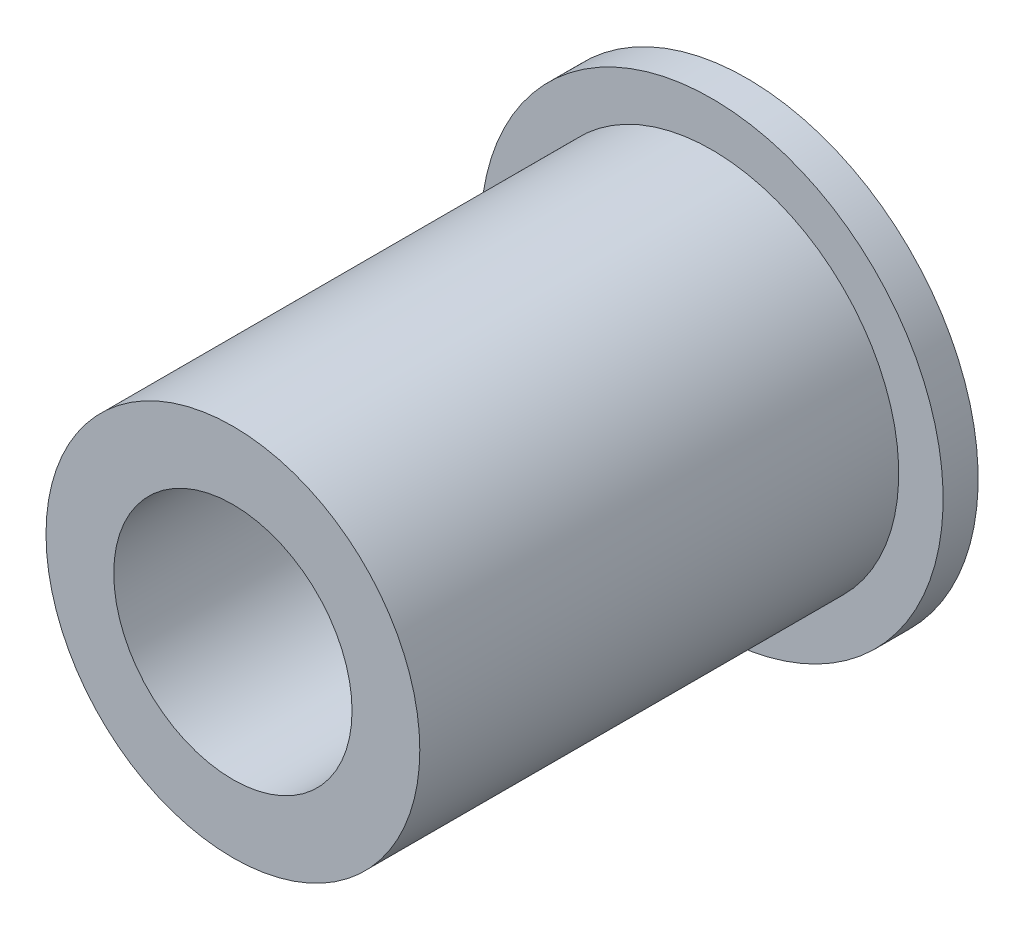
ISO-10303-21;
HEADER;
FILE_DESCRIPTION(('STEP AP214'),'2;1');
FILE_NAME('part.step','',(''),(''),'','','');
FILE_SCHEMA(('AUTOMOTIVE_DESIGN { 1 0 10303 214 1 1 1 1 }'));
ENDSEC;
DATA;
#1=APPLICATION_CONTEXT('core data for automotive mechanical design processes');
#2=APPLICATION_PROTOCOL_DEFINITION('international standard','automotive_design',2000,#1);
#3=PRODUCT_CONTEXT('',#1,'mechanical');
#4=PRODUCT('Part','Part','',(#3));
#5=PRODUCT_RELATED_PRODUCT_CATEGORY('part','',(#4));
#6=PRODUCT_DEFINITION_FORMATION('','',#4);
#7=PRODUCT_DEFINITION_CONTEXT('part definition',#1,'design');
#8=PRODUCT_DEFINITION('design','',#6,#7);
#9=PRODUCT_DEFINITION_SHAPE('','',#8);
#10=(LENGTH_UNIT() NAMED_UNIT(*) SI_UNIT(.MILLI.,.METRE.));
#11=(NAMED_UNIT(*) PLANE_ANGLE_UNIT() SI_UNIT($,.RADIAN.));
#12=(NAMED_UNIT(*) SI_UNIT($,.STERADIAN.) SOLID_ANGLE_UNIT());
#13=UNCERTAINTY_MEASURE_WITH_UNIT(LENGTH_MEASURE(1.E-05),#10,'distance_accuracy_value','');
#14=(GEOMETRIC_REPRESENTATION_CONTEXT(3) GLOBAL_UNCERTAINTY_ASSIGNED_CONTEXT((#13)) GLOBAL_UNIT_ASSIGNED_CONTEXT((#10,
#11,#12)) REPRESENTATION_CONTEXT('',''));
#15=CARTESIAN_POINT('',(0.,0.,0.));
#16=DIRECTION('',(0.,0.,1.));
#17=DIRECTION('',(1.,0.,0.));
#18=AXIS2_PLACEMENT_3D('',#15,#16,#17);
#19=CARTESIAN_POINT('',(0.,0.,22.));
#20=DIRECTION('',(0.,0.,-1.));
#21=DIRECTION('',(-1.,0.,0.));
#22=AXIS2_PLACEMENT_3D('',#19,#20,#21);
#23=CYLINDRICAL_SURFACE('',#22,8.);
#24=CARTESIAN_POINT('',(0.,0.,22.));
#25=DIRECTION('',(0.,0.,1.));
#26=DIRECTION('',(1.,0.,0.));
#27=AXIS2_PLACEMENT_3D('',#24,#25,#26);
#28=CIRCLE('',#27,8.);
#29=CARTESIAN_POINT('',(8.,0.,22.));
#30=VERTEX_POINT('',#29);
#31=EDGE_CURVE('E47',#30,#30,#28,.T.);
#32=ORIENTED_EDGE('',*,*,#31,.F.);
#33=EDGE_LOOP('',(#32));
#34=FACE_BOUND('',#33,.T.);
#35=CARTESIAN_POINT('',(0.,0.,1.5));
#36=DIRECTION('',(0.,0.,-1.));
#37=DIRECTION('',(-1.,0.,0.));
#38=AXIS2_PLACEMENT_3D('',#35,#36,#37);
#39=CIRCLE('',#38,8.);
#40=CARTESIAN_POINT('',(-8.,0.,1.5));
#41=VERTEX_POINT('',#40);
#42=EDGE_CURVE('E11',#41,#41,#39,.T.);
#43=ORIENTED_EDGE('',*,*,#42,.F.);
#44=EDGE_LOOP('',(#43));
#45=FACE_BOUND('',#44,.T.);
#46=ADVANCED_FACE('F39',(#34,#45),#23,.T.);
#47=CARTESIAN_POINT('',(0.,0.,22.));
#48=DIRECTION('',(0.,0.,1.));
#49=DIRECTION('',(1.,0.,0.));
#50=AXIS2_PLACEMENT_3D('',#47,#48,#49);
#51=PLANE('',#50);
#52=CARTESIAN_POINT('',(0.,0.,22.));
#53=DIRECTION('',(0.,0.,1.));
#54=DIRECTION('',(1.,0.,0.));
#55=AXIS2_PLACEMENT_3D('',#52,#53,#54);
#56=CIRCLE('',#55,5.1);
#57=CARTESIAN_POINT('',(5.1,0.,22.));
#58=VERTEX_POINT('',#57);
#59=EDGE_CURVE('E96',#58,#58,#56,.T.);
#60=ORIENTED_EDGE('',*,*,#59,.F.);
#61=EDGE_LOOP('',(#60));
#62=FACE_BOUND('',#61,.T.);
#63=ORIENTED_EDGE('',*,*,#31,.T.);
#64=EDGE_LOOP('',(#63));
#65=FACE_BOUND('',#64,.T.);
#66=ADVANCED_FACE('F110',(#62,#65),#51,.T.);
#67=CARTESIAN_POINT('',(0.,0.,9.));
#68=DIRECTION('',(0.,0.,1.));
#69=DIRECTION('',(1.,0.,0.));
#70=AXIS2_PLACEMENT_3D('',#67,#68,#69);
#71=CYLINDRICAL_SURFACE('',#70,5.1);
#72=CARTESIAN_POINT('',(0.,0.,9.));
#73=DIRECTION('',(0.,0.,1.));
#74=DIRECTION('',(1.,0.,0.));
#75=AXIS2_PLACEMENT_3D('',#72,#73,#74);
#76=CIRCLE('',#75,5.1);
#77=CARTESIAN_POINT('',(5.1,0.,9.));
#78=VERTEX_POINT('',#77);
#79=EDGE_CURVE('E100',#78,#78,#76,.T.);
#80=ORIENTED_EDGE('',*,*,#79,.F.);
#81=EDGE_LOOP('',(#80));
#82=FACE_BOUND('',#81,.T.);
#83=ORIENTED_EDGE('',*,*,#59,.T.);
#84=EDGE_LOOP('',(#83));
#85=FACE_BOUND('',#84,.T.);
#86=ADVANCED_FACE('F136',(#82,#85),#71,.F.);
#87=CARTESIAN_POINT('',(0.,0.,9.));
#88=DIRECTION('',(0.,0.,1.));
#89=DIRECTION('',(1.,0.,0.));
#90=AXIS2_PLACEMENT_3D('',#87,#88,#89);
#91=PLANE('',#90);
#92=CARTESIAN_POINT('',(0.,0.,9.));
#93=DIRECTION('',(0.,0.,1.));
#94=DIRECTION('',(1.,0.,0.));
#95=AXIS2_PLACEMENT_3D('',#92,#93,#94);
#96=CIRCLE('',#95,1.6);
#97=CARTESIAN_POINT('',(-0.858778201865883,1.35,9.));
#98=VERTEX_POINT('',#97);
#99=CARTESIAN_POINT('',(0.858778201865883,1.35,9.));
#100=VERTEX_POINT('',#99);
#101=EDGE_CURVE('E68',#98,#100,#96,.T.);
#102=ORIENTED_EDGE('',*,*,#101,.F.);
#103=DIRECTION('',(-1.,0.,0.));
#104=VECTOR('',#103,1.);
#105=CARTESIAN_POINT('',(0.,1.35,9.));
#106=LINE('',#105,#104);
#107=EDGE_CURVE('E71',#100,#98,#106,.T.);
#108=ORIENTED_EDGE('',*,*,#107,.F.);
#109=EDGE_LOOP('',(#102,#108));
#110=FACE_BOUND('',#109,.T.);
#111=ORIENTED_EDGE('',*,*,#79,.T.);
#112=EDGE_LOOP('',(#111));
#113=FACE_BOUND('',#112,.T.);
#114=ADVANCED_FACE('F125',(#110,#113),#91,.T.);
#115=CARTESIAN_POINT('',(0.,0.,1.5));
#116=DIRECTION('',(0.,0.,-1.));
#117=DIRECTION('',(-1.,0.,0.));
#118=AXIS2_PLACEMENT_3D('',#115,#116,#117);
#119=CYLINDRICAL_SURFACE('',#118,9.9);
#120=CARTESIAN_POINT('',(0.,0.,1.5));
#121=DIRECTION('',(0.,0.,-1.));
#122=DIRECTION('',(-1.,0.,0.));
#123=AXIS2_PLACEMENT_3D('',#120,#121,#122);
#124=CIRCLE('',#123,9.9);
#125=CARTESIAN_POINT('',(-9.9,0.,1.5));
#126=VERTEX_POINT('',#125);
#127=EDGE_CURVE('E92',#126,#126,#124,.T.);
#128=ORIENTED_EDGE('',*,*,#127,.T.);
#129=EDGE_LOOP('',(#128));
#130=FACE_BOUND('',#129,.T.);
#131=CARTESIAN_POINT('',(0.,0.,0.));
#132=DIRECTION('',(0.,0.,-1.));
#133=DIRECTION('',(-1.,0.,0.));
#134=AXIS2_PLACEMENT_3D('',#131,#132,#133);
#135=CIRCLE('',#134,9.9);
#136=CARTESIAN_POINT('',(-9.9,0.,0.));
#137=VERTEX_POINT('',#136);
#138=EDGE_CURVE('E91',#137,#137,#135,.T.);
#139=ORIENTED_EDGE('',*,*,#138,.F.);
#140=EDGE_LOOP('',(#139));
#141=FACE_BOUND('',#140,.T.);
#142=ADVANCED_FACE('F119',(#130,#141),#119,.T.);
#143=CARTESIAN_POINT('',(0.,0.,1.5));
#144=DIRECTION('',(0.,0.,-1.));
#145=DIRECTION('',(-1.,0.,0.));
#146=AXIS2_PLACEMENT_3D('',#143,#144,#145);
#147=PLANE('',#146);
#148=ORIENTED_EDGE('',*,*,#42,.T.);
#149=EDGE_LOOP('',(#148));
#150=FACE_BOUND('',#149,.T.);
#151=ORIENTED_EDGE('',*,*,#127,.F.);
#152=EDGE_LOOP('',(#151));
#153=FACE_BOUND('',#152,.T.);
#154=ADVANCED_FACE('F116',(#150,#153),#147,.F.);
#155=CARTESIAN_POINT('',(0.,0.,0.));
#156=DIRECTION('',(0.,0.,1.));
#157=DIRECTION('',(1.,0.,0.));
#158=AXIS2_PLACEMENT_3D('',#155,#156,#157);
#159=PLANE('',#158);
#160=DIRECTION('',(1.,0.,0.));
#161=VECTOR('',#160,1.);
#162=CARTESIAN_POINT('',(0.858778201865883,1.35,0.));
#163=LINE('',#162,#161);
#164=CARTESIAN_POINT('',(-0.858778201865883,1.35,0.));
#165=VERTEX_POINT('',#164);
#166=CARTESIAN_POINT('',(0.858778201865883,1.35,0.));
#167=VERTEX_POINT('',#166);
#168=EDGE_CURVE('E75',#165,#167,#163,.T.);
#169=ORIENTED_EDGE('',*,*,#168,.F.);
#170=CARTESIAN_POINT('',(0.,0.,0.));
#171=DIRECTION('',(0.,0.,-1.));
#172=DIRECTION('',(-1.,0.,0.));
#173=AXIS2_PLACEMENT_3D('',#170,#171,#172);
#174=CIRCLE('',#173,1.6);
#175=EDGE_CURVE('E61',#167,#165,#174,.T.);
#176=ORIENTED_EDGE('',*,*,#175,.F.);
#177=EDGE_LOOP('',(#169,#176));
#178=FACE_BOUND('',#177,.T.);
#179=ORIENTED_EDGE('',*,*,#138,.T.);
#180=EDGE_LOOP('',(#179));
#181=FACE_BOUND('',#180,.T.);
#182=ADVANCED_FACE('F80',(#178,#181),#159,.F.);
#183=CARTESIAN_POINT('',(0.,0.,22.));
#184=DIRECTION('',(0.,0.,-1.));
#185=DIRECTION('',(-1.,0.,0.));
#186=AXIS2_PLACEMENT_3D('',#183,#184,#185);
#187=CYLINDRICAL_SURFACE('',#186,1.6);
#188=ORIENTED_EDGE('',*,*,#101,.T.);
#189=DIRECTION('',(0.,0.,-1.));
#190=VECTOR('',#189,1.);
#191=CARTESIAN_POINT('',(0.858778201865883,1.35,22.));
#192=LINE('',#191,#190);
#193=EDGE_CURVE('E54',#100,#167,#192,.T.);
#194=ORIENTED_EDGE('',*,*,#193,.T.);
#195=ORIENTED_EDGE('',*,*,#175,.T.);
#196=DIRECTION('',(0.,0.,-1.));
#197=VECTOR('',#196,1.);
#198=CARTESIAN_POINT('',(-0.858778201865883,1.35,22.));
#199=LINE('',#198,#197);
#200=EDGE_CURVE('E72',#98,#165,#199,.T.);
#201=ORIENTED_EDGE('',*,*,#200,.F.);
#202=EDGE_LOOP('',(#188,#194,#195,#201));
#203=FACE_BOUND('',#202,.T.);
#204=ADVANCED_FACE('F66',(#203),#187,.F.);
#205=CARTESIAN_POINT('',(0.858778201865883,1.35,22.));
#206=DIRECTION('',(0.,1.,0.));
#207=DIRECTION('',(0.,0.,1.));
#208=AXIS2_PLACEMENT_3D('',#205,#206,#207);
#209=PLANE('',#208);
#210=ORIENTED_EDGE('',*,*,#107,.T.);
#211=ORIENTED_EDGE('',*,*,#200,.T.);
#212=ORIENTED_EDGE('',*,*,#168,.T.);
#213=ORIENTED_EDGE('',*,*,#193,.F.);
#214=EDGE_LOOP('',(#210,#211,#212,#213));
#215=FACE_BOUND('',#214,.T.);
#216=ADVANCED_FACE('F76',(#215),#209,.F.);
#217=CLOSED_SHELL('',(#46,#66,#86,#114,#142,#154,#182,#204,#216));
#218=MANIFOLD_SOLID_BREP('B2',#217);
#219=ADVANCED_BREP_SHAPE_REPRESENTATION('',(#18,#218),#14);
#220=SHAPE_DEFINITION_REPRESENTATION(#9,#219);
ENDSEC;
END-ISO-10303-21;
